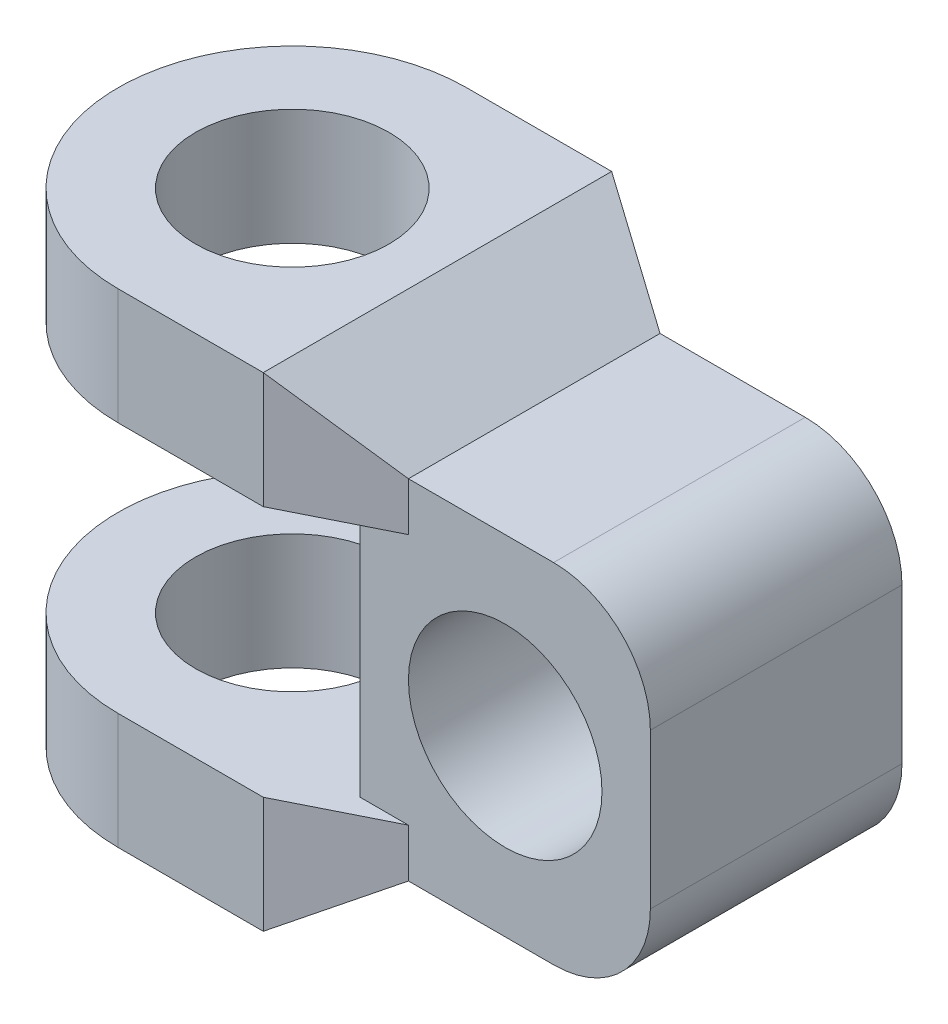
ISO-10303-21;
HEADER;
FILE_DESCRIPTION(('STEP AP214'),'2;1');
FILE_NAME('part.step','',(''),(''),'','','');
FILE_SCHEMA(('AUTOMOTIVE_DESIGN { 1 0 10303 214 1 1 1 1 }'));
ENDSEC;
DATA;
#1=APPLICATION_CONTEXT('core data for automotive mechanical design processes');
#2=APPLICATION_PROTOCOL_DEFINITION('international standard','automotive_design',2000,#1);
#3=PRODUCT_CONTEXT('',#1,'mechanical');
#4=PRODUCT('Part','Part','',(#3));
#5=PRODUCT_RELATED_PRODUCT_CATEGORY('part','',(#4));
#6=PRODUCT_DEFINITION_FORMATION('','',#4);
#7=PRODUCT_DEFINITION_CONTEXT('part definition',#1,'design');
#8=PRODUCT_DEFINITION('design','',#6,#7);
#9=PRODUCT_DEFINITION_SHAPE('','',#8);
#10=(LENGTH_UNIT() NAMED_UNIT(*) SI_UNIT(.MILLI.,.METRE.));
#11=(NAMED_UNIT(*) PLANE_ANGLE_UNIT() SI_UNIT($,.RADIAN.));
#12=(NAMED_UNIT(*) SI_UNIT($,.STERADIAN.) SOLID_ANGLE_UNIT());
#13=UNCERTAINTY_MEASURE_WITH_UNIT(LENGTH_MEASURE(1.E-05),#10,'distance_accuracy_value','');
#14=(GEOMETRIC_REPRESENTATION_CONTEXT(3) GLOBAL_UNCERTAINTY_ASSIGNED_CONTEXT((#13)) GLOBAL_UNIT_ASSIGNED_CONTEXT((#10,
#11,#12)) REPRESENTATION_CONTEXT('',''));
#15=CARTESIAN_POINT('',(0.,0.,0.));
#16=DIRECTION('',(0.,0.,1.));
#17=DIRECTION('',(1.,0.,0.));
#18=AXIS2_PLACEMENT_3D('',#15,#16,#17);
#19=CARTESIAN_POINT('',(15.,0.,18.));
#20=DIRECTION('',(-0.447213595499958,0.,-0.894427190999916));
#21=DIRECTION('',(-0.894427190999916,0.,0.447213595499958));
#22=AXIS2_PLACEMENT_3D('',#19,#20,#21);
#23=PLANE('',#22);
#24=DIRECTION('',(0.,1.,0.));
#25=VECTOR('',#24,1.);
#26=CARTESIAN_POINT('',(25.,0.,13.));
#27=LINE('',#26,#25);
#28=CARTESIAN_POINT('',(25.,7.,13.));
#29=VERTEX_POINT('',#28);
#30=CARTESIAN_POINT('',(25.,12.,13.));
#31=VERTEX_POINT('',#30);
#32=EDGE_CURVE('E311',#29,#31,#27,.T.);
#33=ORIENTED_EDGE('',*,*,#32,.T.);
#34=DIRECTION('',(0.894427190999916,0.,-0.447213595499958));
#35=VECTOR('',#34,1.);
#36=CARTESIAN_POINT('',(13.4,12.,18.8));
#37=LINE('',#36,#35);
#38=CARTESIAN_POINT('',(15.,12.,18.));
#39=VERTEX_POINT('',#38);
#40=EDGE_CURVE('E294',#39,#31,#37,.T.);
#41=ORIENTED_EDGE('',*,*,#40,.F.);
#42=DIRECTION('',(0.,1.,0.));
#43=VECTOR('',#42,1.);
#44=CARTESIAN_POINT('',(15.,0.,18.));
#45=LINE('',#44,#43);
#46=CARTESIAN_POINT('',(15.,0.,18.));
#47=VERTEX_POINT('',#46);
#48=EDGE_CURVE('E305',#47,#39,#45,.T.);
#49=ORIENTED_EDGE('',*,*,#48,.F.);
#50=DIRECTION('',(-0.758098043578903,-0.530668630505232,0.379049021789452));
#51=VECTOR('',#50,1.);
#52=CARTESIAN_POINT('',(15.,0.,18.));
#53=LINE('',#52,#51);
#54=EDGE_CURVE('E231',#29,#47,#53,.T.);
#55=ORIENTED_EDGE('',*,*,#54,.F.);
#56=EDGE_LOOP('',(#33,#41,#49,#55));
#57=FACE_BOUND('',#56,.T.);
#58=ADVANCED_FACE('F32',(#57),#23,.F.);
#59=CARTESIAN_POINT('',(15.,0.,-18.));
#60=DIRECTION('',(-0.447213595499958,0.,0.894427190999916));
#61=DIRECTION('',(0.894427190999916,0.,0.447213595499958));
#62=AXIS2_PLACEMENT_3D('',#59,#60,#61);
#63=PLANE('',#62);
#64=DIRECTION('',(0.,1.,0.));
#65=VECTOR('',#64,1.);
#66=CARTESIAN_POINT('',(25.,0.,-13.));
#67=LINE('',#66,#65);
#68=CARTESIAN_POINT('',(25.,38.,-13.));
#69=VERTEX_POINT('',#68);
#70=CARTESIAN_POINT('',(25.,43.,-13.));
#71=VERTEX_POINT('',#70);
#72=EDGE_CURVE('E296',#69,#71,#67,.T.);
#73=ORIENTED_EDGE('',*,*,#72,.F.);
#74=DIRECTION('',(0.894427190999916,0.,0.447213595499958));
#75=VECTOR('',#74,1.);
#76=CARTESIAN_POINT('',(39.,38.,-6.));
#77=LINE('',#76,#75);
#78=CARTESIAN_POINT('',(15.,38.,-18.));
#79=VERTEX_POINT('',#78);
#80=EDGE_CURVE('E282',#79,#69,#77,.T.);
#81=ORIENTED_EDGE('',*,*,#80,.F.);
#82=DIRECTION('',(0.,1.,0.));
#83=VECTOR('',#82,1.);
#84=CARTESIAN_POINT('',(15.,0.,-18.));
#85=LINE('',#84,#83);
#86=CARTESIAN_POINT('',(15.,50.,-18.));
#87=VERTEX_POINT('',#86);
#88=EDGE_CURVE('E304',#79,#87,#85,.T.);
#89=ORIENTED_EDGE('',*,*,#88,.T.);
#90=DIRECTION('',(-0.758098043578904,0.530668630505232,-0.379049021789452));
#91=VECTOR('',#90,1.);
#92=CARTESIAN_POINT('',(33.9080459770115,36.764367816092,-8.54597701149425));
#93=LINE('',#92,#91);
#94=EDGE_CURVE('E315',#71,#87,#93,.T.);
#95=ORIENTED_EDGE('',*,*,#94,.F.);
#96=EDGE_LOOP('',(#73,#81,#89,#95));
#97=FACE_BOUND('',#96,.T.);
#98=ADVANCED_FACE('F387',(#97),#63,.F.);
#99=CARTESIAN_POINT('',(50.,50.,18.));
#100=DIRECTION('',(0.,0.,-1.));
#101=DIRECTION('',(-1.,0.,0.));
#102=AXIS2_PLACEMENT_3D('',#99,#100,#101);
#103=PLANE('',#102);
#104=DIRECTION('',(1.,0.,0.));
#105=VECTOR('',#104,1.);
#106=CARTESIAN_POINT('',(50.,0.,18.));
#107=LINE('',#106,#105);
#108=CARTESIAN_POINT('',(0.,0.,18.));
#109=VERTEX_POINT('',#108);
#110=EDGE_CURVE('E220',#109,#47,#107,.T.);
#111=ORIENTED_EDGE('',*,*,#110,.T.);
#112=ORIENTED_EDGE('',*,*,#48,.T.);
#113=DIRECTION('',(-1.,0.,0.));
#114=VECTOR('',#113,1.);
#115=CARTESIAN_POINT('',(50.,12.,18.));
#116=LINE('',#115,#114);
#117=CARTESIAN_POINT('',(0.,12.,18.));
#118=VERTEX_POINT('',#117);
#119=EDGE_CURVE('E189',#39,#118,#116,.T.);
#120=ORIENTED_EDGE('',*,*,#119,.T.);
#121=DIRECTION('',(0.,-1.,0.));
#122=VECTOR('',#121,1.);
#123=CARTESIAN_POINT('',(0.,50.,18.));
#124=LINE('',#123,#122);
#125=EDGE_CURVE('E227',#118,#109,#124,.T.);
#126=ORIENTED_EDGE('',*,*,#125,.T.);
#127=EDGE_LOOP('',(#111,#112,#120,#126));
#128=FACE_BOUND('',#127,.T.);
#129=ADVANCED_FACE('F355',(#128),#103,.F.);
#130=CARTESIAN_POINT('',(0.,50.,-18.));
#131=DIRECTION('',(0.,0.,1.));
#132=DIRECTION('',(1.,0.,0.));
#133=AXIS2_PLACEMENT_3D('',#130,#131,#132);
#134=PLANE('',#133);
#135=DIRECTION('',(-1.,0.,0.));
#136=VECTOR('',#135,1.);
#137=CARTESIAN_POINT('',(0.,50.,-18.));
#138=LINE('',#137,#136);
#139=CARTESIAN_POINT('',(0.,50.,-18.));
#140=VERTEX_POINT('',#139);
#141=EDGE_CURVE('E215',#87,#140,#138,.T.);
#142=ORIENTED_EDGE('',*,*,#141,.F.);
#143=ORIENTED_EDGE('',*,*,#88,.F.);
#144=DIRECTION('',(1.,0.,0.));
#145=VECTOR('',#144,1.);
#146=CARTESIAN_POINT('',(20.,38.,-18.));
#147=LINE('',#146,#145);
#148=CARTESIAN_POINT('',(0.,38.,-18.));
#149=VERTEX_POINT('',#148);
#150=EDGE_CURVE('E181',#149,#79,#147,.T.);
#151=ORIENTED_EDGE('',*,*,#150,.F.);
#152=DIRECTION('',(0.,-1.,0.));
#153=VECTOR('',#152,1.);
#154=CARTESIAN_POINT('',(0.,50.,-18.));
#155=LINE('',#154,#153);
#156=EDGE_CURVE('E224',#140,#149,#155,.T.);
#157=ORIENTED_EDGE('',*,*,#156,.F.);
#158=EDGE_LOOP('',(#142,#143,#151,#157));
#159=FACE_BOUND('',#158,.T.);
#160=ADVANCED_FACE('F384',(#159),#134,.F.);
#161=CARTESIAN_POINT('',(0.,50.,0.));
#162=DIRECTION('',(0.,-1.,0.));
#163=DIRECTION('',(0.,0.,-1.));
#164=AXIS2_PLACEMENT_3D('',#161,#162,#163);
#165=CYLINDRICAL_SURFACE('',#164,18.);
#166=ORIENTED_EDGE('',*,*,#156,.T.);
#167=CARTESIAN_POINT('',(0.,38.,0.));
#168=DIRECTION('',(0.,1.,0.));
#169=DIRECTION('',(0.,0.,1.));
#170=AXIS2_PLACEMENT_3D('',#167,#168,#169);
#171=CIRCLE('',#170,18.);
#172=CARTESIAN_POINT('',(0.,38.,18.));
#173=VERTEX_POINT('',#172);
#174=EDGE_CURVE('E198',#149,#173,#171,.T.);
#175=ORIENTED_EDGE('',*,*,#174,.T.);
#176=CARTESIAN_POINT('',(0.,50.,18.));
#177=VERTEX_POINT('',#176);
#178=EDGE_CURVE('E228',#177,#173,#124,.T.);
#179=ORIENTED_EDGE('',*,*,#178,.F.);
#180=CARTESIAN_POINT('',(0.,50.,0.));
#181=DIRECTION('',(0.,1.,0.));
#182=DIRECTION('',(0.,0.,1.));
#183=AXIS2_PLACEMENT_3D('',#180,#181,#182);
#184=CIRCLE('',#183,18.);
#185=EDGE_CURVE('E208',#140,#177,#184,.T.);
#186=ORIENTED_EDGE('',*,*,#185,.F.);
#187=EDGE_LOOP('',(#166,#175,#179,#186));
#188=FACE_BOUND('',#187,.T.);
#189=ADVANCED_FACE('F378',(#188),#165,.T.);
#190=CARTESIAN_POINT('',(0.,50.,0.));
#191=DIRECTION('',(0.,-1.,0.));
#192=DIRECTION('',(0.,0.,-1.));
#193=AXIS2_PLACEMENT_3D('',#190,#191,#192);
#194=CYLINDRICAL_SURFACE('',#193,10.);
#195=CARTESIAN_POINT('',(0.,38.,0.));
#196=DIRECTION('',(0.,1.,0.));
#197=DIRECTION('',(0.,0.,1.));
#198=AXIS2_PLACEMENT_3D('',#195,#196,#197);
#199=CIRCLE('',#198,10.);
#200=CARTESIAN_POINT('',(0.,38.,10.));
#201=VERTEX_POINT('',#200);
#202=EDGE_CURVE('E194',#201,#201,#199,.T.);
#203=ORIENTED_EDGE('',*,*,#202,.F.);
#204=EDGE_LOOP('',(#203));
#205=FACE_BOUND('',#204,.T.);
#206=CARTESIAN_POINT('',(0.,50.,0.));
#207=DIRECTION('',(0.,1.,0.));
#208=DIRECTION('',(0.,0.,1.));
#209=AXIS2_PLACEMENT_3D('',#206,#207,#208);
#210=CIRCLE('',#209,10.);
#211=CARTESIAN_POINT('',(0.,50.,10.));
#212=VERTEX_POINT('',#211);
#213=EDGE_CURVE('E202',#212,#212,#210,.T.);
#214=ORIENTED_EDGE('',*,*,#213,.T.);
#215=EDGE_LOOP('',(#214));
#216=FACE_BOUND('',#215,.T.);
#217=ADVANCED_FACE('F436',(#205,#216),#194,.F.);
#218=CARTESIAN_POINT('',(0.,50.,0.));
#219=DIRECTION('',(0.,1.,0.));
#220=DIRECTION('',(0.,0.,1.));
#221=AXIS2_PLACEMENT_3D('',#218,#219,#220);
#222=PLANE('',#221);
#223=DIRECTION('',(0.,0.,-1.));
#224=VECTOR('',#223,1.);
#225=CARTESIAN_POINT('',(15.,50.,18.));
#226=LINE('',#225,#224);
#227=CARTESIAN_POINT('',(15.,50.,18.));
#228=VERTEX_POINT('',#227);
#229=EDGE_CURVE('E332',#228,#87,#226,.T.);
#230=ORIENTED_EDGE('',*,*,#229,.T.);
#231=ORIENTED_EDGE('',*,*,#141,.T.);
#232=ORIENTED_EDGE('',*,*,#185,.T.);
#233=DIRECTION('',(1.,0.,0.));
#234=VECTOR('',#233,1.);
#235=CARTESIAN_POINT('',(50.,50.,18.));
#236=LINE('',#235,#234);
#237=EDGE_CURVE('E211',#177,#228,#236,.T.);
#238=ORIENTED_EDGE('',*,*,#237,.T.);
#239=EDGE_LOOP('',(#230,#231,#232,#238));
#240=FACE_BOUND('',#239,.T.);
#241=ORIENTED_EDGE('',*,*,#213,.F.);
#242=EDGE_LOOP('',(#241));
#243=FACE_BOUND('',#242,.T.);
#244=ADVANCED_FACE('F372',(#240,#243),#222,.T.);
#245=CARTESIAN_POINT('',(0.,0.,0.));
#246=DIRECTION('',(0.,1.,0.));
#247=DIRECTION('',(0.,0.,1.));
#248=AXIS2_PLACEMENT_3D('',#245,#246,#247);
#249=PLANE('',#248);
#250=DIRECTION('',(-1.,0.,0.));
#251=VECTOR('',#250,1.);
#252=CARTESIAN_POINT('',(0.,0.,-18.));
#253=LINE('',#252,#251);
#254=CARTESIAN_POINT('',(15.,0.,-18.));
#255=VERTEX_POINT('',#254);
#256=CARTESIAN_POINT('',(0.,0.,-18.));
#257=VERTEX_POINT('',#256);
#258=EDGE_CURVE('E212',#255,#257,#253,.T.);
#259=ORIENTED_EDGE('',*,*,#258,.F.);
#260=DIRECTION('',(0.,0.,-1.));
#261=VECTOR('',#260,1.);
#262=CARTESIAN_POINT('',(15.,0.,18.));
#263=LINE('',#262,#261);
#264=EDGE_CURVE('E329',#47,#255,#263,.T.);
#265=ORIENTED_EDGE('',*,*,#264,.F.);
#266=ORIENTED_EDGE('',*,*,#110,.F.);
#267=CARTESIAN_POINT('',(0.,0.,0.));
#268=DIRECTION('',(0.,1.,0.));
#269=DIRECTION('',(0.,0.,1.));
#270=AXIS2_PLACEMENT_3D('',#267,#268,#269);
#271=CIRCLE('',#270,18.);
#272=EDGE_CURVE('E205',#257,#109,#271,.T.);
#273=ORIENTED_EDGE('',*,*,#272,.F.);
#274=EDGE_LOOP('',(#259,#265,#266,#273));
#275=FACE_BOUND('',#274,.T.);
#276=CARTESIAN_POINT('',(0.,0.,0.));
#277=DIRECTION('',(0.,1.,0.));
#278=DIRECTION('',(0.,0.,1.));
#279=AXIS2_PLACEMENT_3D('',#276,#277,#278);
#280=CIRCLE('',#279,10.);
#281=CARTESIAN_POINT('',(0.,0.,10.));
#282=VERTEX_POINT('',#281);
#283=EDGE_CURVE('E201',#282,#282,#280,.T.);
#284=ORIENTED_EDGE('',*,*,#283,.T.);
#285=EDGE_LOOP('',(#284));
#286=FACE_BOUND('',#285,.T.);
#287=ADVANCED_FACE('F351',(#275,#286),#249,.F.);
#288=ORIENTED_EDGE('',*,*,#125,.F.);
#289=CARTESIAN_POINT('',(0.,12.,0.));
#290=DIRECTION('',(0.,-1.,0.));
#291=DIRECTION('',(0.,0.,-1.));
#292=AXIS2_PLACEMENT_3D('',#289,#290,#291);
#293=CIRCLE('',#292,18.);
#294=CARTESIAN_POINT('',(0.,12.,-18.));
#295=VERTEX_POINT('',#294);
#296=EDGE_CURVE('E191',#118,#295,#293,.T.);
#297=ORIENTED_EDGE('',*,*,#296,.T.);
#298=EDGE_CURVE('E217',#295,#257,#155,.T.);
#299=ORIENTED_EDGE('',*,*,#298,.T.);
#300=ORIENTED_EDGE('',*,*,#272,.T.);
#301=EDGE_LOOP('',(#288,#297,#299,#300));
#302=FACE_BOUND('',#301,.T.);
#303=ADVANCED_FACE('F345',(#302),#165,.T.);
#304=DIRECTION('',(1.,0.,0.));
#305=VECTOR('',#304,1.);
#306=CARTESIAN_POINT('',(50.,38.,18.));
#307=LINE('',#306,#305);
#308=CARTESIAN_POINT('',(15.,38.,18.));
#309=VERTEX_POINT('',#308);
#310=EDGE_CURVE('E195',#173,#309,#307,.T.);
#311=ORIENTED_EDGE('',*,*,#310,.T.);
#312=EDGE_CURVE('E308',#309,#228,#45,.T.);
#313=ORIENTED_EDGE('',*,*,#312,.T.);
#314=ORIENTED_EDGE('',*,*,#237,.F.);
#315=ORIENTED_EDGE('',*,*,#178,.T.);
#316=EDGE_LOOP('',(#311,#313,#314,#315));
#317=FACE_BOUND('',#316,.T.);
#318=ADVANCED_FACE('F366',(#317),#103,.F.);
#319=CARTESIAN_POINT('',(50.,50.,-18.));
#320=DIRECTION('',(-1.,0.,0.));
#321=DIRECTION('',(0.,0.,1.));
#322=AXIS2_PLACEMENT_3D('',#319,#320,#321);
#323=PLANE('',#322);
#324=DIRECTION('',(0.,1.,0.));
#325=VECTOR('',#324,1.);
#326=CARTESIAN_POINT('',(50.,0.,-13.));
#327=LINE('',#326,#325);
#328=CARTESIAN_POINT('',(50.,17.,-13.));
#329=VERTEX_POINT('',#328);
#330=CARTESIAN_POINT('',(50.,33.,-13.));
#331=VERTEX_POINT('',#330);
#332=EDGE_CURVE('E287',#329,#331,#327,.T.);
#333=ORIENTED_EDGE('',*,*,#332,.T.);
#334=DIRECTION('',(0.,0.,-1.));
#335=VECTOR('',#334,1.);
#336=CARTESIAN_POINT('',(50.,33.,-18.));
#337=LINE('',#336,#335);
#338=CARTESIAN_POINT('',(50.,33.,13.));
#339=VERTEX_POINT('',#338);
#340=EDGE_CURVE('E256',#331,#339,#337,.F.);
#341=ORIENTED_EDGE('',*,*,#340,.T.);
#342=DIRECTION('',(0.,1.,0.));
#343=VECTOR('',#342,1.);
#344=CARTESIAN_POINT('',(50.,0.,13.));
#345=LINE('',#344,#343);
#346=CARTESIAN_POINT('',(50.,17.,13.));
#347=VERTEX_POINT('',#346);
#348=EDGE_CURVE('E270',#347,#339,#345,.T.);
#349=ORIENTED_EDGE('',*,*,#348,.F.);
#350=DIRECTION('',(0.,0.,-1.));
#351=VECTOR('',#350,1.);
#352=CARTESIAN_POINT('',(50.,17.,-18.));
#353=LINE('',#352,#351);
#354=EDGE_CURVE('E253',#347,#329,#353,.T.);
#355=ORIENTED_EDGE('',*,*,#354,.T.);
#356=EDGE_LOOP('',(#333,#341,#349,#355));
#357=FACE_BOUND('',#356,.T.);
#358=ADVANCED_FACE('F290',(#357),#323,.F.);
#359=DIRECTION('',(-1.,0.,0.));
#360=VECTOR('',#359,1.);
#361=CARTESIAN_POINT('',(20.,12.,-18.));
#362=LINE('',#361,#360);
#363=CARTESIAN_POINT('',(15.,12.,-18.));
#364=VERTEX_POINT('',#363);
#365=EDGE_CURVE('E186',#364,#295,#362,.T.);
#366=ORIENTED_EDGE('',*,*,#365,.F.);
#367=EDGE_CURVE('E302',#255,#364,#85,.T.);
#368=ORIENTED_EDGE('',*,*,#367,.F.);
#369=ORIENTED_EDGE('',*,*,#258,.T.);
#370=ORIENTED_EDGE('',*,*,#298,.F.);
#371=EDGE_LOOP('',(#366,#368,#369,#370));
#372=FACE_BOUND('',#371,.T.);
#373=ADVANCED_FACE('F347',(#372),#134,.F.);
#374=CARTESIAN_POINT('',(0.,12.,0.));
#375=DIRECTION('',(0.,-1.,0.));
#376=DIRECTION('',(0.,0.,-1.));
#377=AXIS2_PLACEMENT_3D('',#374,#375,#376);
#378=CIRCLE('',#377,10.);
#379=CARTESIAN_POINT('',(0.,12.,-10.));
#380=VERTEX_POINT('',#379);
#381=EDGE_CURVE('E183',#380,#380,#378,.T.);
#382=ORIENTED_EDGE('',*,*,#381,.F.);
#383=EDGE_LOOP('',(#382));
#384=FACE_BOUND('',#383,.T.);
#385=ORIENTED_EDGE('',*,*,#283,.F.);
#386=EDGE_LOOP('',(#385));
#387=FACE_BOUND('',#386,.T.);
#388=ADVANCED_FACE('F432',(#384,#387),#194,.F.);
#389=CARTESIAN_POINT('',(20.,12.,32.));
#390=DIRECTION('',(1.,0.,0.));
#391=DIRECTION('',(0.,0.,-1.));
#392=AXIS2_PLACEMENT_3D('',#389,#390,#391);
#393=PLANE('',#392);
#394=DIRECTION('',(0.,0.,-1.));
#395=VECTOR('',#394,1.);
#396=CARTESIAN_POINT('',(20.,38.,32.));
#397=LINE('',#396,#395);
#398=CARTESIAN_POINT('',(20.,38.,13.));
#399=VERTEX_POINT('',#398);
#400=CARTESIAN_POINT('',(20.,38.,-13.));
#401=VERTEX_POINT('',#400);
#402=EDGE_CURVE('E175',#399,#401,#397,.T.);
#403=ORIENTED_EDGE('',*,*,#402,.T.);
#404=DIRECTION('',(0.,1.,0.));
#405=VECTOR('',#404,1.);
#406=CARTESIAN_POINT('',(20.,38.,-13.));
#407=LINE('',#406,#405);
#408=CARTESIAN_POINT('',(20.,12.,-13.));
#409=VERTEX_POINT('',#408);
#410=EDGE_CURVE('E161',#409,#401,#407,.T.);
#411=ORIENTED_EDGE('',*,*,#410,.F.);
#412=DIRECTION('',(0.,0.,-1.));
#413=VECTOR('',#412,1.);
#414=CARTESIAN_POINT('',(20.,12.,32.));
#415=LINE('',#414,#413);
#416=CARTESIAN_POINT('',(20.,12.,13.));
#417=VERTEX_POINT('',#416);
#418=EDGE_CURVE('E173',#417,#409,#415,.T.);
#419=ORIENTED_EDGE('',*,*,#418,.F.);
#420=DIRECTION('',(0.,-1.,0.));
#421=VECTOR('',#420,1.);
#422=CARTESIAN_POINT('',(20.,38.,13.));
#423=LINE('',#422,#421);
#424=EDGE_CURVE('E361',#399,#417,#423,.T.);
#425=ORIENTED_EDGE('',*,*,#424,.F.);
#426=EDGE_LOOP('',(#403,#411,#419,#425));
#427=FACE_BOUND('',#426,.T.);
#428=ADVANCED_FACE('F171',(#427),#393,.F.);
#429=CARTESIAN_POINT('',(20.,38.,32.));
#430=DIRECTION('',(0.,1.,0.));
#431=DIRECTION('',(0.,0.,1.));
#432=AXIS2_PLACEMENT_3D('',#429,#430,#431);
#433=PLANE('',#432);
#434=ORIENTED_EDGE('',*,*,#202,.T.);
#435=EDGE_LOOP('',(#434));
#436=FACE_BOUND('',#435,.T.);
#437=ORIENTED_EDGE('',*,*,#150,.T.);
#438=ORIENTED_EDGE('',*,*,#80,.T.);
#439=DIRECTION('',(-1.,0.,0.));
#440=VECTOR('',#439,1.);
#441=CARTESIAN_POINT('',(70.,38.,-13.));
#442=LINE('',#441,#440);
#443=EDGE_CURVE('E167',#69,#401,#442,.T.);
#444=ORIENTED_EDGE('',*,*,#443,.T.);
#445=ORIENTED_EDGE('',*,*,#402,.F.);
#446=DIRECTION('',(-1.,0.,0.));
#447=VECTOR('',#446,1.);
#448=CARTESIAN_POINT('',(70.,38.,13.));
#449=LINE('',#448,#447);
#450=CARTESIAN_POINT('',(25.,38.,13.));
#451=VERTEX_POINT('',#450);
#452=EDGE_CURVE('E299',#451,#399,#449,.T.);
#453=ORIENTED_EDGE('',*,*,#452,.F.);
#454=DIRECTION('',(-0.894427190999916,0.,0.447213595499958));
#455=VECTOR('',#454,1.);
#456=CARTESIAN_POINT('',(13.4,38.,18.8));
#457=LINE('',#456,#455);
#458=EDGE_CURVE('E47',#451,#309,#457,.T.);
#459=ORIENTED_EDGE('',*,*,#458,.T.);
#460=ORIENTED_EDGE('',*,*,#310,.F.);
#461=ORIENTED_EDGE('',*,*,#174,.F.);
#462=EDGE_LOOP('',(#437,#438,#444,#445,#453,#459,#460,#461));
#463=FACE_BOUND('',#462,.T.);
#464=ADVANCED_FACE('F381',(#436,#463),#433,.F.);
#465=CARTESIAN_POINT('',(20.,12.,32.));
#466=DIRECTION('',(0.,-1.,0.));
#467=DIRECTION('',(0.,0.,-1.));
#468=AXIS2_PLACEMENT_3D('',#465,#466,#467);
#469=PLANE('',#468);
#470=ORIENTED_EDGE('',*,*,#381,.T.);
#471=EDGE_LOOP('',(#470));
#472=FACE_BOUND('',#471,.T.);
#473=ORIENTED_EDGE('',*,*,#40,.T.);
#474=DIRECTION('',(-1.,0.,0.));
#475=VECTOR('',#474,1.);
#476=CARTESIAN_POINT('',(70.,12.,13.));
#477=LINE('',#476,#475);
#478=EDGE_CURVE('E176',#31,#417,#477,.T.);
#479=ORIENTED_EDGE('',*,*,#478,.T.);
#480=ORIENTED_EDGE('',*,*,#418,.T.);
#481=DIRECTION('',(-1.,0.,0.));
#482=VECTOR('',#481,1.);
#483=CARTESIAN_POINT('',(70.,12.,-13.));
#484=LINE('',#483,#482);
#485=CARTESIAN_POINT('',(25.,12.,-13.));
#486=VERTEX_POINT('',#485);
#487=EDGE_CURVE('E156',#486,#409,#484,.T.);
#488=ORIENTED_EDGE('',*,*,#487,.F.);
#489=DIRECTION('',(-0.894427190999916,0.,-0.447213595499958));
#490=VECTOR('',#489,1.);
#491=CARTESIAN_POINT('',(39.,12.,-6.));
#492=LINE('',#491,#490);
#493=EDGE_CURVE('E55',#486,#364,#492,.T.);
#494=ORIENTED_EDGE('',*,*,#493,.T.);
#495=ORIENTED_EDGE('',*,*,#365,.T.);
#496=ORIENTED_EDGE('',*,*,#296,.F.);
#497=ORIENTED_EDGE('',*,*,#119,.F.);
#498=EDGE_LOOP('',(#473,#479,#480,#488,#494,#495,#496,#497));
#499=FACE_BOUND('',#498,.T.);
#500=ADVANCED_FACE('F178',(#472,#499),#469,.F.);
#501=CARTESIAN_POINT('',(25.,43.,18.));
#502=DIRECTION('',(-0.573462344363328,-0.81923192051904,0.));
#503=DIRECTION('',(0.819231920519041,-0.573462344363328,0.));
#504=AXIS2_PLACEMENT_3D('',#501,#502,#503);
#505=PLANE('',#504);
#506=DIRECTION('',(0.,0.,-1.));
#507=VECTOR('',#506,1.);
#508=CARTESIAN_POINT('',(25.,43.,18.));
#509=LINE('',#508,#507);
#510=CARTESIAN_POINT('',(25.,43.,13.));
#511=VERTEX_POINT('',#510);
#512=EDGE_CURVE('E280',#511,#71,#509,.T.);
#513=ORIENTED_EDGE('',*,*,#512,.T.);
#514=ORIENTED_EDGE('',*,*,#94,.T.);
#515=ORIENTED_EDGE('',*,*,#229,.F.);
#516=DIRECTION('',(0.758098043578904,-0.530668630505232,-0.379049021789452));
#517=VECTOR('',#516,1.);
#518=CARTESIAN_POINT('',(23.5632183908046,44.0057471264368,13.7183908045977));
#519=LINE('',#518,#517);
#520=EDGE_CURVE('E292',#228,#511,#519,.T.);
#521=ORIENTED_EDGE('',*,*,#520,.T.);
#522=EDGE_LOOP('',(#513,#514,#515,#521));
#523=FACE_BOUND('',#522,.T.);
#524=ADVANCED_FACE('F368',(#523),#505,.F.);
#525=CARTESIAN_POINT('',(50.,43.,18.));
#526=DIRECTION('',(0.,-1.,0.));
#527=DIRECTION('',(0.,0.,-1.));
#528=AXIS2_PLACEMENT_3D('',#525,#526,#527);
#529=PLANE('',#528);
#530=DIRECTION('',(1.,0.,0.));
#531=VECTOR('',#530,1.);
#532=CARTESIAN_POINT('',(50.,43.,13.));
#533=LINE('',#532,#531);
#534=CARTESIAN_POINT('',(40.,43.,13.));
#535=VERTEX_POINT('',#534);
#536=EDGE_CURVE('E267',#511,#535,#533,.T.);
#537=ORIENTED_EDGE('',*,*,#536,.T.);
#538=DIRECTION('',(0.,0.,-1.));
#539=VECTOR('',#538,1.);
#540=CARTESIAN_POINT('',(40.,43.,18.));
#541=LINE('',#540,#539);
#542=CARTESIAN_POINT('',(40.,43.,-13.));
#543=VERTEX_POINT('',#542);
#544=EDGE_CURVE('E246',#535,#543,#541,.T.);
#545=ORIENTED_EDGE('',*,*,#544,.T.);
#546=DIRECTION('',(-1.,0.,0.));
#547=VECTOR('',#546,1.);
#548=CARTESIAN_POINT('',(50.,43.,-13.));
#549=LINE('',#548,#547);
#550=EDGE_CURVE('E288',#543,#71,#549,.T.);
#551=ORIENTED_EDGE('',*,*,#550,.T.);
#552=ORIENTED_EDGE('',*,*,#512,.F.);
#553=EDGE_LOOP('',(#537,#545,#551,#552));
#554=FACE_BOUND('',#553,.T.);
#555=ADVANCED_FACE('F276',(#554),#529,.F.);
#556=CARTESIAN_POINT('',(25.,7.,18.));
#557=DIRECTION('',(0.,1.,0.));
#558=DIRECTION('',(-1.,0.,0.));
#559=AXIS2_PLACEMENT_3D('',#556,#557,#558);
#560=PLANE('',#559);
#561=DIRECTION('',(1.,0.,0.));
#562=VECTOR('',#561,1.);
#563=CARTESIAN_POINT('',(25.,7.,-13.));
#564=LINE('',#563,#562);
#565=CARTESIAN_POINT('',(25.,7.,-13.));
#566=VERTEX_POINT('',#565);
#567=CARTESIAN_POINT('',(40.,7.,-13.));
#568=VERTEX_POINT('',#567);
#569=EDGE_CURVE('E243',#566,#568,#564,.T.);
#570=ORIENTED_EDGE('',*,*,#569,.T.);
#571=DIRECTION('',(0.,0.,-1.));
#572=VECTOR('',#571,1.);
#573=CARTESIAN_POINT('',(40.,7.,18.));
#574=LINE('',#573,#572);
#575=CARTESIAN_POINT('',(40.,7.,13.));
#576=VERTEX_POINT('',#575);
#577=EDGE_CURVE('E11',#568,#576,#574,.F.);
#578=ORIENTED_EDGE('',*,*,#577,.T.);
#579=DIRECTION('',(-1.,0.,0.));
#580=VECTOR('',#579,1.);
#581=CARTESIAN_POINT('',(25.,7.,13.));
#582=LINE('',#581,#580);
#583=EDGE_CURVE('E241',#576,#29,#582,.T.);
#584=ORIENTED_EDGE('',*,*,#583,.T.);
#585=DIRECTION('',(0.,0.,-1.));
#586=VECTOR('',#585,1.);
#587=CARTESIAN_POINT('',(25.,7.,18.));
#588=LINE('',#587,#586);
#589=EDGE_CURVE('E326',#29,#566,#588,.T.);
#590=ORIENTED_EDGE('',*,*,#589,.T.);
#591=EDGE_LOOP('',(#570,#578,#584,#590));
#592=FACE_BOUND('',#591,.T.);
#593=ADVANCED_FACE('F530',(#592),#560,.F.);
#594=CARTESIAN_POINT('',(15.,0.,18.));
#595=DIRECTION('',(-0.573462344363328,0.81923192051904,0.));
#596=DIRECTION('',(-0.81923192051904,-0.573462344363328,0.));
#597=AXIS2_PLACEMENT_3D('',#594,#595,#596);
#598=PLANE('',#597);
#599=ORIENTED_EDGE('',*,*,#264,.T.);
#600=DIRECTION('',(0.758098043578903,0.530668630505232,0.379049021789452));
#601=VECTOR('',#600,1.);
#602=CARTESIAN_POINT('',(25.3448275862069,7.24137931034483,-12.8275862068966));
#603=LINE('',#602,#601);
#604=EDGE_CURVE('E238',#255,#566,#603,.T.);
#605=ORIENTED_EDGE('',*,*,#604,.T.);
#606=ORIENTED_EDGE('',*,*,#589,.F.);
#607=ORIENTED_EDGE('',*,*,#54,.T.);
#608=EDGE_LOOP('',(#599,#605,#606,#607));
#609=FACE_BOUND('',#608,.T.);
#610=ADVANCED_FACE('F399',(#609),#598,.F.);
#611=CARTESIAN_POINT('',(25.,0.,13.));
#612=DIRECTION('',(0.,0.,-1.));
#613=DIRECTION('',(-1.,0.,0.));
#614=AXIS2_PLACEMENT_3D('',#611,#612,#613);
#615=PLANE('',#614);
#616=EDGE_CURVE('E309',#451,#511,#27,.T.);
#617=ORIENTED_EDGE('',*,*,#616,.F.);
#618=ORIENTED_EDGE('',*,*,#452,.T.);
#619=ORIENTED_EDGE('',*,*,#424,.T.);
#620=ORIENTED_EDGE('',*,*,#478,.F.);
#621=ORIENTED_EDGE('',*,*,#32,.F.);
#622=ORIENTED_EDGE('',*,*,#583,.F.);
#623=CARTESIAN_POINT('',(40.,17.,13.));
#624=DIRECTION('',(0.,0.,-1.));
#625=DIRECTION('',(-1.,0.,0.));
#626=AXIS2_PLACEMENT_3D('',#623,#624,#625);
#627=CIRCLE('',#626,10.);
#628=EDGE_CURVE('E258',#576,#347,#627,.F.);
#629=ORIENTED_EDGE('',*,*,#628,.T.);
#630=ORIENTED_EDGE('',*,*,#348,.T.);
#631=CARTESIAN_POINT('',(40.,33.,13.));
#632=DIRECTION('',(0.,0.,-1.));
#633=DIRECTION('',(-1.,0.,0.));
#634=AXIS2_PLACEMENT_3D('',#631,#632,#633);
#635=CIRCLE('',#634,10.);
#636=EDGE_CURVE('E40',#339,#535,#635,.F.);
#637=ORIENTED_EDGE('',*,*,#636,.T.);
#638=ORIENTED_EDGE('',*,*,#536,.F.);
#639=EDGE_LOOP('',(#617,#618,#619,#620,#621,#622,#629,#630,#637,#638));
#640=FACE_BOUND('',#639,.T.);
#641=CARTESIAN_POINT('',(35.,25.,13.));
#642=DIRECTION('',(0.,0.,-1.));
#643=DIRECTION('',(-1.,0.,0.));
#644=AXIS2_PLACEMENT_3D('',#641,#642,#643);
#645=CIRCLE('',#644,10.);
#646=CARTESIAN_POINT('',(25.,25.,13.));
#647=VERTEX_POINT('',#646);
#648=EDGE_CURVE('E281',#647,#647,#645,.F.);
#649=ORIENTED_EDGE('',*,*,#648,.F.);
#650=EDGE_LOOP('',(#649));
#651=FACE_BOUND('',#650,.T.);
#652=ADVANCED_FACE('F265',(#640,#651),#615,.F.);
#653=ORIENTED_EDGE('',*,*,#458,.F.);
#654=ORIENTED_EDGE('',*,*,#616,.T.);
#655=ORIENTED_EDGE('',*,*,#520,.F.);
#656=ORIENTED_EDGE('',*,*,#312,.F.);
#657=EDGE_LOOP('',(#653,#654,#655,#656));
#658=FACE_BOUND('',#657,.T.);
#659=ADVANCED_FACE('F390',(#658),#23,.F.);
#660=CARTESIAN_POINT('',(25.,0.,-13.));
#661=DIRECTION('',(0.,0.,1.));
#662=DIRECTION('',(1.,0.,0.));
#663=AXIS2_PLACEMENT_3D('',#660,#661,#662);
#664=PLANE('',#663);
#665=EDGE_CURVE('E164',#566,#486,#67,.T.);
#666=ORIENTED_EDGE('',*,*,#665,.T.);
#667=ORIENTED_EDGE('',*,*,#487,.T.);
#668=ORIENTED_EDGE('',*,*,#410,.T.);
#669=ORIENTED_EDGE('',*,*,#443,.F.);
#670=ORIENTED_EDGE('',*,*,#72,.T.);
#671=ORIENTED_EDGE('',*,*,#550,.F.);
#672=CARTESIAN_POINT('',(40.,33.,-13.));
#673=DIRECTION('',(0.,0.,1.));
#674=DIRECTION('',(1.,0.,0.));
#675=AXIS2_PLACEMENT_3D('',#672,#673,#674);
#676=CIRCLE('',#675,10.);
#677=EDGE_CURVE('E251',#543,#331,#676,.F.);
#678=ORIENTED_EDGE('',*,*,#677,.T.);
#679=ORIENTED_EDGE('',*,*,#332,.F.);
#680=CARTESIAN_POINT('',(40.,17.,-13.));
#681=DIRECTION('',(0.,0.,1.));
#682=DIRECTION('',(1.,0.,0.));
#683=AXIS2_PLACEMENT_3D('',#680,#681,#682);
#684=CIRCLE('',#683,10.);
#685=EDGE_CURVE('E249',#329,#568,#684,.F.);
#686=ORIENTED_EDGE('',*,*,#685,.T.);
#687=ORIENTED_EDGE('',*,*,#569,.F.);
#688=EDGE_LOOP('',(#666,#667,#668,#669,#670,#671,#678,#679,#686,#687));
#689=FACE_BOUND('',#688,.T.);
#690=CARTESIAN_POINT('',(35.,25.,-13.));
#691=DIRECTION('',(0.,0.,1.));
#692=DIRECTION('',(1.,0.,0.));
#693=AXIS2_PLACEMENT_3D('',#690,#691,#692);
#694=CIRCLE('',#693,10.);
#695=CARTESIAN_POINT('',(45.,25.,-13.));
#696=VERTEX_POINT('',#695);
#697=EDGE_CURVE('E323',#696,#696,#694,.F.);
#698=ORIENTED_EDGE('',*,*,#697,.F.);
#699=EDGE_LOOP('',(#698));
#700=FACE_BOUND('',#699,.T.);
#701=ADVANCED_FACE('F158',(#689,#700),#664,.F.);
#702=ORIENTED_EDGE('',*,*,#493,.F.);
#703=ORIENTED_EDGE('',*,*,#665,.F.);
#704=ORIENTED_EDGE('',*,*,#604,.F.);
#705=ORIENTED_EDGE('',*,*,#367,.T.);
#706=EDGE_LOOP('',(#702,#703,#704,#705));
#707=FACE_BOUND('',#706,.T.);
#708=ADVANCED_FACE('F397',(#707),#63,.F.);
#709=CARTESIAN_POINT('',(35.,25.,32.));
#710=DIRECTION('',(0.,0.,-1.));
#711=DIRECTION('',(-1.,0.,0.));
#712=AXIS2_PLACEMENT_3D('',#709,#710,#711);
#713=CYLINDRICAL_SURFACE('',#712,10.);
#714=ORIENTED_EDGE('',*,*,#697,.T.);
#715=EDGE_LOOP('',(#714));
#716=FACE_BOUND('',#715,.T.);
#717=ORIENTED_EDGE('',*,*,#648,.T.);
#718=EDGE_LOOP('',(#717));
#719=FACE_BOUND('',#718,.T.);
#720=ADVANCED_FACE('F411',(#716,#719),#713,.F.);
#721=CARTESIAN_POINT('',(40.,33.,18.));
#722=DIRECTION('',(0.,0.,-1.));
#723=DIRECTION('',(-1.,0.,0.));
#724=AXIS2_PLACEMENT_3D('',#721,#722,#723);
#725=CYLINDRICAL_SURFACE('',#724,10.);
#726=ORIENTED_EDGE('',*,*,#636,.F.);
#727=ORIENTED_EDGE('',*,*,#340,.F.);
#728=ORIENTED_EDGE('',*,*,#677,.F.);
#729=ORIENTED_EDGE('',*,*,#544,.F.);
#730=EDGE_LOOP('',(#726,#727,#728,#729));
#731=FACE_BOUND('',#730,.T.);
#732=ADVANCED_FACE('F284',(#731),#725,.T.);
#733=CARTESIAN_POINT('',(40.,17.,-18.));
#734=DIRECTION('',(0.,0.,-1.));
#735=DIRECTION('',(-1.,0.,0.));
#736=AXIS2_PLACEMENT_3D('',#733,#734,#735);
#737=CYLINDRICAL_SURFACE('',#736,10.);
#738=ORIENTED_EDGE('',*,*,#628,.F.);
#739=ORIENTED_EDGE('',*,*,#577,.F.);
#740=ORIENTED_EDGE('',*,*,#685,.F.);
#741=ORIENTED_EDGE('',*,*,#354,.F.);
#742=EDGE_LOOP('',(#738,#739,#740,#741));
#743=FACE_BOUND('',#742,.T.);
#744=ADVANCED_FACE('F34',(#743),#737,.T.);
#745=CLOSED_SHELL('',(#58,#98,#129,#160,#189,#217,#244,#287,#303,#318,#358,#373,#388,#428,#464,
#500,#524,#555,#593,#610,#652,#659,#701,#708,#720,#732,#744));
#746=MANIFOLD_SOLID_BREP('B2',#745);
#747=ADVANCED_BREP_SHAPE_REPRESENTATION('',(#18,#746),#14);
#748=SHAPE_DEFINITION_REPRESENTATION(#9,#747);
ENDSEC;
END-ISO-10303-21;
